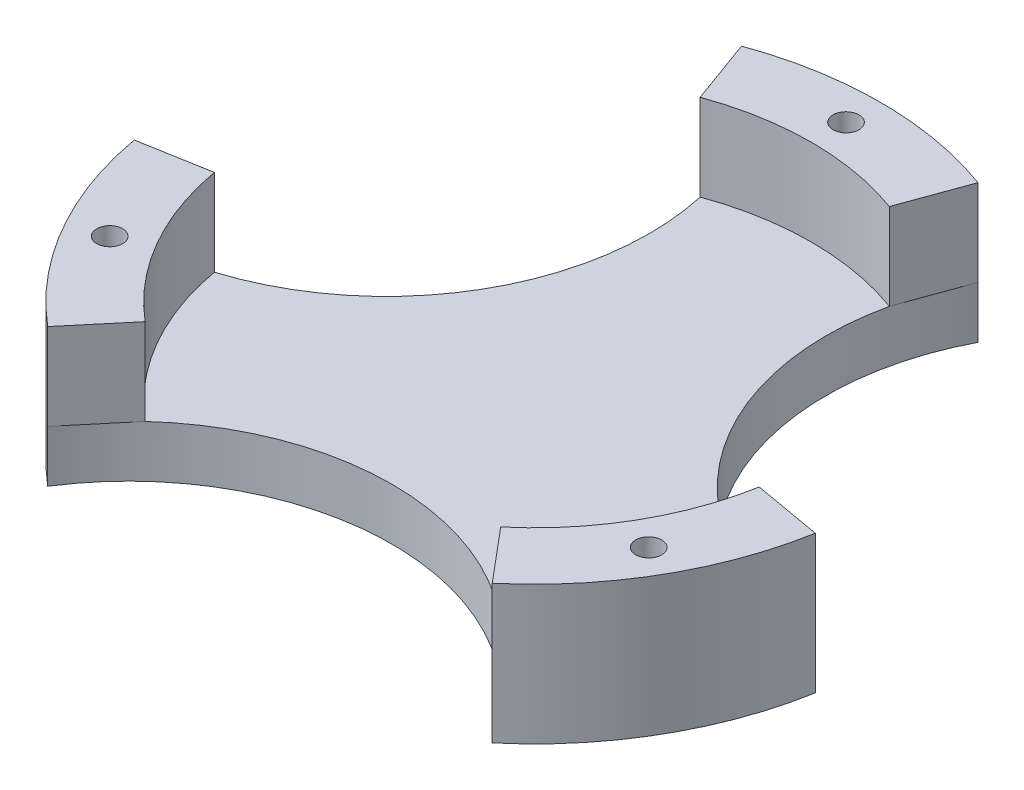
ISO-10303-21;
HEADER;
FILE_DESCRIPTION(('STEP AP214'),'2;1');
FILE_NAME('part.step','',(''),(''),'','','');
FILE_SCHEMA(('AUTOMOTIVE_DESIGN { 1 0 10303 214 1 1 1 1 }'));
ENDSEC;
DATA;
#1=APPLICATION_CONTEXT('core data for automotive mechanical design processes');
#2=APPLICATION_PROTOCOL_DEFINITION('international standard','automotive_design',2000,#1);
#3=PRODUCT_CONTEXT('',#1,'mechanical');
#4=PRODUCT('Part','Part','',(#3));
#5=PRODUCT_RELATED_PRODUCT_CATEGORY('part','',(#4));
#6=PRODUCT_DEFINITION_FORMATION('','',#4);
#7=PRODUCT_DEFINITION_CONTEXT('part definition',#1,'design');
#8=PRODUCT_DEFINITION('design','',#6,#7);
#9=PRODUCT_DEFINITION_SHAPE('','',#8);
#10=(LENGTH_UNIT() NAMED_UNIT(*) SI_UNIT(.MILLI.,.METRE.));
#11=(NAMED_UNIT(*) PLANE_ANGLE_UNIT() SI_UNIT($,.RADIAN.));
#12=(NAMED_UNIT(*) SI_UNIT($,.STERADIAN.) SOLID_ANGLE_UNIT());
#13=UNCERTAINTY_MEASURE_WITH_UNIT(LENGTH_MEASURE(1.E-05),#10,'distance_accuracy_value','');
#14=(GEOMETRIC_REPRESENTATION_CONTEXT(3) GLOBAL_UNCERTAINTY_ASSIGNED_CONTEXT((#13)) GLOBAL_UNIT_ASSIGNED_CONTEXT((#10,
#11,#12)) REPRESENTATION_CONTEXT('',''));
#15=CARTESIAN_POINT('',(0.,0.,0.));
#16=DIRECTION('',(0.,0.,1.));
#17=DIRECTION('',(1.,0.,0.));
#18=AXIS2_PLACEMENT_3D('',#15,#16,#17);
#19=CARTESIAN_POINT('',(0.,6.,0.));
#20=DIRECTION('',(0.,-1.,0.));
#21=DIRECTION('',(0.,0.,-1.));
#22=AXIS2_PLACEMENT_3D('',#19,#20,#21);
#23=CYLINDRICAL_SURFACE('',#22,40.);
#24=CARTESIAN_POINT('',(0.,0.,0.));
#25=DIRECTION('',(0.,1.,0.));
#26=DIRECTION('',(0.,0.,1.));
#27=AXIS2_PLACEMENT_3D('',#24,#25,#26);
#28=CIRCLE('',#27,40.);
#29=CARTESIAN_POINT('',(13.6808057330268,0.,-37.5877048314363));
#30=VERTEX_POINT('',#29);
#31=CARTESIAN_POINT('',(-13.680805733027,0.,-37.5877048314362));
#32=VERTEX_POINT('',#31);
#33=EDGE_CURVE('E11',#30,#32,#28,.T.);
#34=ORIENTED_EDGE('',*,*,#33,.T.);
#35=DIRECTION('',(0.,1.,0.));
#36=VECTOR('',#35,1.);
#37=CARTESIAN_POINT('',(-13.680805733027,3.,-37.5877048314362));
#38=LINE('',#37,#36);
#39=CARTESIAN_POINT('',(-13.6808057330251,6.,-37.5877048314326));
#40=VERTEX_POINT('',#39);
#41=EDGE_CURVE('E299',#32,#40,#38,.T.);
#42=ORIENTED_EDGE('',*,*,#41,.T.);
#43=DIRECTION('',(0.,-1.,0.));
#44=VECTOR('',#43,1.);
#45=CARTESIAN_POINT('',(-13.6808057330265,16.,-37.5877048314364));
#46=LINE('',#45,#44);
#47=CARTESIAN_POINT('',(-13.6808057330265,16.,-37.5877048314364));
#48=VERTEX_POINT('',#47);
#49=EDGE_CURVE('E263',#48,#40,#46,.T.);
#50=ORIENTED_EDGE('',*,*,#49,.F.);
#51=CARTESIAN_POINT('',(0.,16.,0.));
#52=DIRECTION('',(0.,1.,0.));
#53=DIRECTION('',(0.,0.,1.));
#54=AXIS2_PLACEMENT_3D('',#51,#52,#53);
#55=CIRCLE('',#54,40.);
#56=CARTESIAN_POINT('',(13.6808057330268,16.,-37.5877048314363));
#57=VERTEX_POINT('',#56);
#58=EDGE_CURVE('E241',#57,#48,#55,.T.);
#59=ORIENTED_EDGE('',*,*,#58,.F.);
#60=DIRECTION('',(0.,-1.,0.));
#61=VECTOR('',#60,1.);
#62=CARTESIAN_POINT('',(13.6808057330268,16.,-37.5877048314363));
#63=LINE('',#62,#61);
#64=CARTESIAN_POINT('',(13.6808057330268,6.,-37.5877048314364));
#65=VERTEX_POINT('',#64);
#66=EDGE_CURVE('E248',#57,#65,#63,.T.);
#67=ORIENTED_EDGE('',*,*,#66,.T.);
#68=DIRECTION('',(0.,1.,0.));
#69=VECTOR('',#68,1.);
#70=CARTESIAN_POINT('',(13.6808057330268,3.,-37.5877048314363));
#71=LINE('',#70,#69);
#72=EDGE_CURVE('E305',#65,#30,#71,.F.);
#73=ORIENTED_EDGE('',*,*,#72,.T.);
#74=EDGE_LOOP('',(#34,#42,#50,#59,#67,#73));
#75=FACE_BOUND('',#74,.T.);
#76=ADVANCED_FACE('F39',(#75),#23,.T.);
#77=DIRECTION('',(0.,-1.,0.));
#78=VECTOR('',#77,1.);
#79=CARTESIAN_POINT('',(-39.3923101204883,16.,6.94592710667737));
#80=LINE('',#79,#78);
#81=CARTESIAN_POINT('',(-39.3923101204883,16.,6.94592710667737));
#82=VERTEX_POINT('',#81);
#83=CARTESIAN_POINT('',(-39.3923101204883,6.,6.94592710667737));
#84=VERTEX_POINT('',#83);
#85=EDGE_CURVE('E218',#82,#84,#80,.T.);
#86=ORIENTED_EDGE('',*,*,#85,.T.);
#87=DIRECTION('',(0.,1.,0.));
#88=VECTOR('',#87,1.);
#89=CARTESIAN_POINT('',(-39.3923101204883,3.,6.94592710667738));
#90=LINE('',#89,#88);
#91=CARTESIAN_POINT('',(-39.3923101204883,0.,6.94592710667738));
#92=VERTEX_POINT('',#91);
#93=EDGE_CURVE('E280',#84,#92,#90,.F.);
#94=ORIENTED_EDGE('',*,*,#93,.T.);
#95=CARTESIAN_POINT('',(-25.7115043874612,0.,30.6417777247594));
#96=VERTEX_POINT('',#95);
#97=EDGE_CURVE('E47',#92,#96,#28,.T.);
#98=ORIENTED_EDGE('',*,*,#97,.T.);
#99=DIRECTION('',(0.,1.,0.));
#100=VECTOR('',#99,1.);
#101=CARTESIAN_POINT('',(-25.7115043874612,3.,30.6417777247594));
#102=LINE('',#101,#100);
#103=CARTESIAN_POINT('',(-25.711504387459,6.,30.641777724756));
#104=VERTEX_POINT('',#103);
#105=EDGE_CURVE('E278',#96,#104,#102,.T.);
#106=ORIENTED_EDGE('',*,*,#105,.T.);
#107=DIRECTION('',(0.,-1.,0.));
#108=VECTOR('',#107,1.);
#109=CARTESIAN_POINT('',(-25.7115043874616,16.,30.6417777247591));
#110=LINE('',#109,#108);
#111=CARTESIAN_POINT('',(-25.7115043874616,16.,30.6417777247591));
#112=VERTEX_POINT('',#111);
#113=EDGE_CURVE('E231',#112,#104,#110,.T.);
#114=ORIENTED_EDGE('',*,*,#113,.F.);
#115=CARTESIAN_POINT('',(0.,16.,0.));
#116=DIRECTION('',(0.,1.,0.));
#117=DIRECTION('',(0.866025403784436,0.,-0.500000000000004));
#118=AXIS2_PLACEMENT_3D('',#115,#116,#117);
#119=CIRCLE('',#118,40.);
#120=EDGE_CURVE('E208',#82,#112,#119,.T.);
#121=ORIENTED_EDGE('',*,*,#120,.F.);
#122=EDGE_LOOP('',(#86,#94,#98,#106,#114,#121));
#123=FACE_BOUND('',#122,.T.);
#124=ADVANCED_FACE('F276',(#123),#23,.T.);
#125=DIRECTION('',(0.,-1.,0.));
#126=VECTOR('',#125,1.);
#127=CARTESIAN_POINT('',(25.7115043874618,16.,30.6417777247589));
#128=LINE('',#127,#126);
#129=CARTESIAN_POINT('',(25.7115043874618,16.,30.6417777247589));
#130=VERTEX_POINT('',#129);
#131=CARTESIAN_POINT('',(25.7115043874618,6.,30.6417777247589));
#132=VERTEX_POINT('',#131);
#133=EDGE_CURVE('E187',#130,#132,#128,.T.);
#134=ORIENTED_EDGE('',*,*,#133,.T.);
#135=DIRECTION('',(0.,1.,0.));
#136=VECTOR('',#135,1.);
#137=CARTESIAN_POINT('',(25.7115043874618,3.,30.6417777247589));
#138=LINE('',#137,#136);
#139=CARTESIAN_POINT('',(25.7115043874618,0.,30.6417777247589));
#140=VERTEX_POINT('',#139);
#141=EDGE_CURVE('E166',#132,#140,#138,.F.);
#142=ORIENTED_EDGE('',*,*,#141,.T.);
#143=CARTESIAN_POINT('',(39.3923101204883,0.,6.9459271066771));
#144=VERTEX_POINT('',#143);
#145=EDGE_CURVE('E48',#140,#144,#28,.T.);
#146=ORIENTED_EDGE('',*,*,#145,.T.);
#147=DIRECTION('',(0.,1.,0.));
#148=VECTOR('',#147,1.);
#149=CARTESIAN_POINT('',(39.3923101204883,3.,6.9459271066771));
#150=LINE('',#149,#148);
#151=CARTESIAN_POINT('',(39.3923101204885,6.,6.94592710667711));
#152=VERTEX_POINT('',#151);
#153=EDGE_CURVE('E312',#144,#152,#150,.T.);
#154=ORIENTED_EDGE('',*,*,#153,.T.);
#155=DIRECTION('',(0.,-1.,0.));
#156=VECTOR('',#155,1.);
#157=CARTESIAN_POINT('',(39.3923101204883,16.,6.94592710667708));
#158=LINE('',#157,#156);
#159=CARTESIAN_POINT('',(39.3923101204883,16.,6.94592710667708));
#160=VERTEX_POINT('',#159);
#161=EDGE_CURVE('E201',#160,#152,#158,.T.);
#162=ORIENTED_EDGE('',*,*,#161,.F.);
#163=CARTESIAN_POINT('',(0.,16.,0.));
#164=DIRECTION('',(0.,1.,0.));
#165=DIRECTION('',(-0.866025403784443,0.,-0.499999999999992));
#166=AXIS2_PLACEMENT_3D('',#163,#164,#165);
#167=CIRCLE('',#166,40.);
#168=EDGE_CURVE('E155',#130,#160,#167,.T.);
#169=ORIENTED_EDGE('',*,*,#168,.F.);
#170=EDGE_LOOP('',(#134,#142,#146,#154,#162,#169));
#171=FACE_BOUND('',#170,.T.);
#172=ADVANCED_FACE('F41',(#171),#23,.T.);
#173=CARTESIAN_POINT('',(0.,6.,0.));
#174=DIRECTION('',(0.,1.,0.));
#175=DIRECTION('',(0.,0.,1.));
#176=AXIS2_PLACEMENT_3D('',#173,#174,#175);
#177=PLANE('',#176);
#178=CARTESIAN_POINT('',(-40.698571494497,6.,-23.4973312079807));
#179=DIRECTION('',(0.,1.,0.));
#180=DIRECTION('',(0.866025403784436,0.,-0.500000000000004));
#181=AXIS2_PLACEMENT_3D('',#178,#179,#180);
#182=CIRCLE('',#181,30.4712700029097);
#183=CARTESIAN_POINT('',(-31.5138480963906,6.,5.55674168534189));
#184=VERTEX_POINT('',#183);
#185=CARTESIAN_POINT('',(-10.9446445864216,6.,-30.070163865149));
#186=VERTEX_POINT('',#185);
#187=EDGE_CURVE('E291',#184,#186,#182,.T.);
#188=ORIENTED_EDGE('',*,*,#187,.F.);
#189=CARTESIAN_POINT('',(0.,6.,0.));
#190=DIRECTION('',(0.,-1.,0.));
#191=DIRECTION('',(0.866025403784436,0.,-0.500000000000004));
#192=AXIS2_PLACEMENT_3D('',#189,#190,#191);
#193=CIRCLE('',#192,32.);
#194=CARTESIAN_POINT('',(-20.569203509969,6.,24.5134221798075));
#195=VERTEX_POINT('',#194);
#196=EDGE_CURVE('E178',#195,#184,#193,.T.);
#197=ORIENTED_EDGE('',*,*,#196,.F.);
#198=CARTESIAN_POINT('',(4.8919202022546E-13,6.,46.9946624159619));
#199=DIRECTION('',(0.,1.,0.));
#200=DIRECTION('',(-0.866025403784443,0.,-0.499999999999992));
#201=AXIS2_PLACEMENT_3D('',#198,#199,#200);
#202=CIRCLE('',#201,30.4712700029097);
#203=CARTESIAN_POINT('',(20.5692035099694,6.,24.5134221798071));
#204=VERTEX_POINT('',#203);
#205=EDGE_CURVE('E163',#204,#195,#202,.T.);
#206=ORIENTED_EDGE('',*,*,#205,.F.);
#207=CARTESIAN_POINT('',(0.,6.,0.));
#208=DIRECTION('',(0.,-1.,0.));
#209=DIRECTION('',(-0.866025403784443,0.,-0.499999999999992));
#210=AXIS2_PLACEMENT_3D('',#207,#208,#209);
#211=CIRCLE('',#210,32.);
#212=CARTESIAN_POINT('',(31.5138480963907,6.,5.55674168534168));
#213=VERTEX_POINT('',#212);
#214=EDGE_CURVE('E156',#213,#204,#211,.T.);
#215=ORIENTED_EDGE('',*,*,#214,.F.);
#216=CARTESIAN_POINT('',(40.6985714944968,6.,-23.497331207981));
#217=DIRECTION('',(0.,1.,0.));
#218=DIRECTION('',(0.,0.,1.));
#219=AXIS2_PLACEMENT_3D('',#216,#217,#218);
#220=CIRCLE('',#219,30.4712700029097);
#221=CARTESIAN_POINT('',(10.9446445864214,6.,-30.070163865149));
#222=VERTEX_POINT('',#221);
#223=EDGE_CURVE('E309',#222,#213,#220,.T.);
#224=ORIENTED_EDGE('',*,*,#223,.F.);
#225=CARTESIAN_POINT('',(0.,6.,0.));
#226=DIRECTION('',(0.,-1.,0.));
#227=DIRECTION('',(0.,0.,1.));
#228=AXIS2_PLACEMENT_3D('',#225,#226,#227);
#229=CIRCLE('',#228,32.);
#230=EDGE_CURVE('E251',#186,#222,#229,.T.);
#231=ORIENTED_EDGE('',*,*,#230,.F.);
#232=EDGE_LOOP('',(#188,#197,#206,#215,#224,#231));
#233=FACE_BOUND('',#232,.T.);
#234=ADVANCED_FACE('F174',(#233),#177,.T.);
#235=CARTESIAN_POINT('',(0.,0.,0.));
#236=DIRECTION('',(0.,1.,0.));
#237=DIRECTION('',(0.,0.,1.));
#238=AXIS2_PLACEMENT_3D('',#235,#236,#237);
#239=PLANE('',#238);
#240=CARTESIAN_POINT('',(-31.1769145362397,0.,18.0000000000001));
#241=DIRECTION('',(0.,1.,0.));
#242=DIRECTION('',(0.866025403784436,0.,-0.500000000000004));
#243=AXIS2_PLACEMENT_3D('',#240,#241,#242);
#244=CIRCLE('',#243,1.5);
#245=CARTESIAN_POINT('',(-29.8778764305631,0.,17.2500000000001));
#246=VERTEX_POINT('',#245);
#247=EDGE_CURVE('E315',#246,#246,#244,.T.);
#248=ORIENTED_EDGE('',*,*,#247,.T.);
#249=EDGE_LOOP('',(#248));
#250=FACE_BOUND('',#249,.T.);
#251=CARTESIAN_POINT('',(31.17691453624,0.,17.9999999999997));
#252=DIRECTION('',(0.,1.,0.));
#253=DIRECTION('',(-0.866025403784443,0.,-0.499999999999992));
#254=AXIS2_PLACEMENT_3D('',#251,#252,#253);
#255=CIRCLE('',#254,1.5);
#256=CARTESIAN_POINT('',(29.8778764305633,0.,17.2499999999997));
#257=VERTEX_POINT('',#256);
#258=EDGE_CURVE('E314',#257,#257,#255,.T.);
#259=ORIENTED_EDGE('',*,*,#258,.T.);
#260=EDGE_LOOP('',(#259));
#261=FACE_BOUND('',#260,.T.);
#262=CARTESIAN_POINT('',(0.,0.,-36.));
#263=DIRECTION('',(0.,1.,0.));
#264=DIRECTION('',(0.,0.,1.));
#265=AXIS2_PLACEMENT_3D('',#262,#263,#264);
#266=CIRCLE('',#265,1.5);
#267=CARTESIAN_POINT('',(0.,0.,-34.5));
#268=VERTEX_POINT('',#267);
#269=EDGE_CURVE('E234',#268,#268,#266,.T.);
#270=ORIENTED_EDGE('',*,*,#269,.T.);
#271=EDGE_LOOP('',(#270));
#272=FACE_BOUND('',#271,.T.);
#273=ORIENTED_EDGE('',*,*,#97,.F.);
#274=CARTESIAN_POINT('',(-40.698571494497,0.,-23.4973312079807));
#275=DIRECTION('',(0.,1.,0.));
#276=DIRECTION('',(0.866025403784436,0.,-0.500000000000004));
#277=AXIS2_PLACEMENT_3D('',#274,#275,#276);
#278=CIRCLE('',#277,30.4712700029097);
#279=EDGE_CURVE('E286',#92,#32,#278,.T.);
#280=ORIENTED_EDGE('',*,*,#279,.T.);
#281=ORIENTED_EDGE('',*,*,#33,.F.);
#282=CARTESIAN_POINT('',(40.6985714944968,0.,-23.497331207981));
#283=DIRECTION('',(0.,1.,0.));
#284=DIRECTION('',(0.,0.,1.));
#285=AXIS2_PLACEMENT_3D('',#282,#283,#284);
#286=CIRCLE('',#285,30.4712700029097);
#287=EDGE_CURVE('E303',#30,#144,#286,.T.);
#288=ORIENTED_EDGE('',*,*,#287,.T.);
#289=ORIENTED_EDGE('',*,*,#145,.F.);
#290=CARTESIAN_POINT('',(4.8919202022546E-13,0.,46.9946624159619));
#291=DIRECTION('',(0.,1.,0.));
#292=DIRECTION('',(-0.866025403784443,0.,-0.499999999999992));
#293=AXIS2_PLACEMENT_3D('',#290,#291,#292);
#294=CIRCLE('',#293,30.4712700029097);
#295=EDGE_CURVE('E167',#140,#96,#294,.T.);
#296=ORIENTED_EDGE('',*,*,#295,.T.);
#297=EDGE_LOOP('',(#273,#280,#281,#288,#289,#296));
#298=FACE_BOUND('',#297,.T.);
#299=ADVANCED_FACE('F284',(#250,#261,#272,#298),#239,.F.);
#300=CARTESIAN_POINT('',(0.,16.,0.));
#301=DIRECTION('',(0.,1.,0.));
#302=DIRECTION('',(0.,0.,1.));
#303=AXIS2_PLACEMENT_3D('',#300,#301,#302);
#304=PLANE('',#303);
#305=ORIENTED_EDGE('',*,*,#58,.T.);
#306=DIRECTION('',(0.342020143325663,0.,0.93969262078591));
#307=VECTOR('',#306,1.);
#308=CARTESIAN_POINT('',(-13.6808057330265,16.,-37.5877048314364));
#309=LINE('',#308,#307);
#310=CARTESIAN_POINT('',(-10.9446445864212,16.,-30.0701638651491));
#311=VERTEX_POINT('',#310);
#312=EDGE_CURVE('E243',#48,#311,#309,.T.);
#313=ORIENTED_EDGE('',*,*,#312,.T.);
#314=CARTESIAN_POINT('',(0.,16.,0.));
#315=DIRECTION('',(0.,-1.,0.));
#316=DIRECTION('',(0.,0.,1.));
#317=AXIS2_PLACEMENT_3D('',#314,#315,#316);
#318=CIRCLE('',#317,32.);
#319=CARTESIAN_POINT('',(10.9446445864214,16.,-30.0701638651491));
#320=VERTEX_POINT('',#319);
#321=EDGE_CURVE('E60',#311,#320,#318,.T.);
#322=ORIENTED_EDGE('',*,*,#321,.T.);
#323=DIRECTION('',(0.34202014332567,0.,-0.939692620785908));
#324=VECTOR('',#323,1.);
#325=CARTESIAN_POINT('',(10.9446445864214,16.,-30.0701638651491));
#326=LINE('',#325,#324);
#327=EDGE_CURVE('E55',#320,#57,#326,.T.);
#328=ORIENTED_EDGE('',*,*,#327,.T.);
#329=EDGE_LOOP('',(#305,#313,#322,#328));
#330=FACE_BOUND('',#329,.T.);
#331=CARTESIAN_POINT('',(0.,16.,-36.));
#332=DIRECTION('',(0.,1.,0.));
#333=DIRECTION('',(0.,0.,1.));
#334=AXIS2_PLACEMENT_3D('',#331,#332,#333);
#335=CIRCLE('',#334,1.5);
#336=CARTESIAN_POINT('',(0.,16.,-34.5));
#337=VERTEX_POINT('',#336);
#338=EDGE_CURVE('E237',#337,#337,#335,.T.);
#339=ORIENTED_EDGE('',*,*,#338,.F.);
#340=EDGE_LOOP('',(#339));
#341=FACE_BOUND('',#340,.T.);
#342=ADVANCED_FACE('F349',(#330,#341),#304,.T.);
#343=CARTESIAN_POINT('',(-13.6808057330265,16.,-37.5877048314364));
#344=DIRECTION('',(0.93969262078591,0.,-0.342020143325663));
#345=DIRECTION('',(-0.342020143325663,0.,-0.93969262078591));
#346=AXIS2_PLACEMENT_3D('',#343,#344,#345);
#347=PLANE('',#346);
#348=DIRECTION('',(0.342020143325663,0.,0.93969262078591));
#349=VECTOR('',#348,1.);
#350=CARTESIAN_POINT('',(-13.6808057330265,6.,-37.5877048314364));
#351=LINE('',#350,#349);
#352=EDGE_CURVE('E240',#40,#186,#351,.T.);
#353=ORIENTED_EDGE('',*,*,#352,.T.);
#354=DIRECTION('',(0.,-1.,0.));
#355=VECTOR('',#354,1.);
#356=CARTESIAN_POINT('',(-10.9446445864212,16.,-30.0701638651491));
#357=LINE('',#356,#355);
#358=EDGE_CURVE('E261',#311,#186,#357,.T.);
#359=ORIENTED_EDGE('',*,*,#358,.F.);
#360=ORIENTED_EDGE('',*,*,#312,.F.);
#361=ORIENTED_EDGE('',*,*,#49,.T.);
#362=EDGE_LOOP('',(#353,#359,#360,#361));
#363=FACE_BOUND('',#362,.T.);
#364=ADVANCED_FACE('F351',(#363),#347,.F.);
#365=CARTESIAN_POINT('',(0.,16.,0.));
#366=DIRECTION('',(0.,-1.,0.));
#367=DIRECTION('',(0.,0.,-1.));
#368=AXIS2_PLACEMENT_3D('',#365,#366,#367);
#369=CYLINDRICAL_SURFACE('',#368,32.);
#370=ORIENTED_EDGE('',*,*,#230,.T.);
#371=DIRECTION('',(0.,-1.,0.));
#372=VECTOR('',#371,1.);
#373=CARTESIAN_POINT('',(10.9446445864214,16.,-30.0701638651491));
#374=LINE('',#373,#372);
#375=EDGE_CURVE('E258',#320,#222,#374,.T.);
#376=ORIENTED_EDGE('',*,*,#375,.F.);
#377=ORIENTED_EDGE('',*,*,#321,.F.);
#378=ORIENTED_EDGE('',*,*,#358,.T.);
#379=EDGE_LOOP('',(#370,#376,#377,#378));
#380=FACE_BOUND('',#379,.T.);
#381=ADVANCED_FACE('F343',(#380),#369,.F.);
#382=CARTESIAN_POINT('',(10.9446445864214,16.,-30.0701638651491));
#383=DIRECTION('',(-0.939692620785908,0.,-0.34202014332567));
#384=DIRECTION('',(-0.34202014332567,0.,0.939692620785908));
#385=AXIS2_PLACEMENT_3D('',#382,#383,#384);
#386=PLANE('',#385);
#387=DIRECTION('',(0.34202014332567,0.,-0.939692620785908));
#388=VECTOR('',#387,1.);
#389=CARTESIAN_POINT('',(10.9446445864214,6.,-30.0701638651491));
#390=LINE('',#389,#388);
#391=EDGE_CURVE('E244',#222,#65,#390,.T.);
#392=ORIENTED_EDGE('',*,*,#391,.T.);
#393=ORIENTED_EDGE('',*,*,#66,.F.);
#394=ORIENTED_EDGE('',*,*,#327,.F.);
#395=ORIENTED_EDGE('',*,*,#375,.T.);
#396=EDGE_LOOP('',(#392,#393,#394,#395));
#397=FACE_BOUND('',#396,.T.);
#398=ADVANCED_FACE('F346',(#397),#386,.F.);
#399=CARTESIAN_POINT('',(0.,16.,-36.));
#400=DIRECTION('',(0.,-1.,0.));
#401=DIRECTION('',(0.,0.,-1.));
#402=AXIS2_PLACEMENT_3D('',#399,#400,#401);
#403=CYLINDRICAL_SURFACE('',#402,1.5);
#404=ORIENTED_EDGE('',*,*,#338,.T.);
#405=EDGE_LOOP('',(#404));
#406=FACE_BOUND('',#405,.T.);
#407=ORIENTED_EDGE('',*,*,#269,.F.);
#408=EDGE_LOOP('',(#407));
#409=FACE_BOUND('',#408,.T.);
#410=ADVANCED_FACE('F389',(#406,#409),#403,.F.);
#411=CARTESIAN_POINT('',(0.,16.,0.));
#412=DIRECTION('',(0.,1.,0.));
#413=DIRECTION('',(0.866025403784436,0.,-0.500000000000004));
#414=AXIS2_PLACEMENT_3D('',#411,#412,#413);
#415=PLANE('',#414);
#416=ORIENTED_EDGE('',*,*,#120,.T.);
#417=DIRECTION('',(0.64278760968654,0.,-0.766044443118977));
#418=VECTOR('',#417,1.);
#419=CARTESIAN_POINT('',(-25.7115043874616,16.,30.6417777247591));
#420=LINE('',#419,#418);
#421=CARTESIAN_POINT('',(-20.5692035099693,16.,24.5134221798073));
#422=VERTEX_POINT('',#421);
#423=EDGE_CURVE('E211',#112,#422,#420,.T.);
#424=ORIENTED_EDGE('',*,*,#423,.T.);
#425=CARTESIAN_POINT('',(0.,16.,0.));
#426=DIRECTION('',(0.,-1.,0.));
#427=DIRECTION('',(0.866025403784436,0.,-0.500000000000004));
#428=AXIS2_PLACEMENT_3D('',#425,#426,#427);
#429=CIRCLE('',#428,32.);
#430=CARTESIAN_POINT('',(-31.5138480963906,16.,5.55674168534189));
#431=VERTEX_POINT('',#430);
#432=EDGE_CURVE('E214',#422,#431,#429,.T.);
#433=ORIENTED_EDGE('',*,*,#432,.T.);
#434=DIRECTION('',(-0.984807753012208,0.,0.173648177666934));
#435=VECTOR('',#434,1.);
#436=CARTESIAN_POINT('',(-31.5138480963906,16.,5.55674168534189));
#437=LINE('',#436,#435);
#438=EDGE_CURVE('E216',#431,#82,#437,.T.);
#439=ORIENTED_EDGE('',*,*,#438,.T.);
#440=EDGE_LOOP('',(#416,#424,#433,#439));
#441=FACE_BOUND('',#440,.T.);
#442=CARTESIAN_POINT('',(-31.1769145362397,16.,18.0000000000001));
#443=DIRECTION('',(0.,1.,0.));
#444=DIRECTION('',(0.866025403784436,0.,-0.500000000000004));
#445=AXIS2_PLACEMENT_3D('',#442,#443,#444);
#446=CIRCLE('',#445,1.5);
#447=CARTESIAN_POINT('',(-29.8778764305631,16.,17.2500000000001));
#448=VERTEX_POINT('',#447);
#449=EDGE_CURVE('E204',#448,#448,#446,.T.);
#450=ORIENTED_EDGE('',*,*,#449,.F.);
#451=EDGE_LOOP('',(#450));
#452=FACE_BOUND('',#451,.T.);
#453=ADVANCED_FACE('F394',(#441,#452),#415,.T.);
#454=CARTESIAN_POINT('',(-25.7115043874616,16.,30.6417777247591));
#455=DIRECTION('',(-0.766044443118977,0.,-0.64278760968654));
#456=DIRECTION('',(-0.64278760968654,0.,0.766044443118977));
#457=AXIS2_PLACEMENT_3D('',#454,#455,#456);
#458=PLANE('',#457);
#459=DIRECTION('',(0.64278760968654,0.,-0.766044443118977));
#460=VECTOR('',#459,1.);
#461=CARTESIAN_POINT('',(-25.7115043874616,6.,30.6417777247591));
#462=LINE('',#461,#460);
#463=EDGE_CURVE('E207',#104,#195,#462,.T.);
#464=ORIENTED_EDGE('',*,*,#463,.T.);
#465=DIRECTION('',(0.,-1.,0.));
#466=VECTOR('',#465,1.);
#467=CARTESIAN_POINT('',(-20.5692035099693,16.,24.5134221798073));
#468=LINE('',#467,#466);
#469=EDGE_CURVE('E228',#422,#195,#468,.T.);
#470=ORIENTED_EDGE('',*,*,#469,.F.);
#471=ORIENTED_EDGE('',*,*,#423,.F.);
#472=ORIENTED_EDGE('',*,*,#113,.T.);
#473=EDGE_LOOP('',(#464,#470,#471,#472));
#474=FACE_BOUND('',#473,.T.);
#475=ADVANCED_FACE('F396',(#474),#458,.F.);
#476=CARTESIAN_POINT('',(0.,16.,0.));
#477=DIRECTION('',(0.,-1.,0.));
#478=DIRECTION('',(0.,0.,-1.));
#479=AXIS2_PLACEMENT_3D('',#476,#477,#478);
#480=CYLINDRICAL_SURFACE('',#479,32.);
#481=ORIENTED_EDGE('',*,*,#196,.T.);
#482=DIRECTION('',(0.,-1.,0.));
#483=VECTOR('',#482,1.);
#484=CARTESIAN_POINT('',(-31.5138480963906,16.,5.55674168534189));
#485=LINE('',#484,#483);
#486=EDGE_CURVE('E225',#431,#184,#485,.T.);
#487=ORIENTED_EDGE('',*,*,#486,.F.);
#488=ORIENTED_EDGE('',*,*,#432,.F.);
#489=ORIENTED_EDGE('',*,*,#469,.T.);
#490=EDGE_LOOP('',(#481,#487,#488,#489));
#491=FACE_BOUND('',#490,.T.);
#492=ADVANCED_FACE('F399',(#491),#480,.F.);
#493=CARTESIAN_POINT('',(-31.5138480963906,16.,5.55674168534189));
#494=DIRECTION('',(0.173648177666934,0.,0.984807753012208));
#495=DIRECTION('',(0.984807753012208,0.,-0.173648177666934));
#496=AXIS2_PLACEMENT_3D('',#493,#494,#495);
#497=PLANE('',#496);
#498=DIRECTION('',(-0.984807753012208,0.,0.173648177666934));
#499=VECTOR('',#498,1.);
#500=CARTESIAN_POINT('',(-31.5138480963906,6.,5.55674168534189));
#501=LINE('',#500,#499);
#502=EDGE_CURVE('E212',#184,#84,#501,.T.);
#503=ORIENTED_EDGE('',*,*,#502,.T.);
#504=ORIENTED_EDGE('',*,*,#85,.F.);
#505=ORIENTED_EDGE('',*,*,#438,.F.);
#506=ORIENTED_EDGE('',*,*,#486,.T.);
#507=EDGE_LOOP('',(#503,#504,#505,#506));
#508=FACE_BOUND('',#507,.T.);
#509=ADVANCED_FACE('F403',(#508),#497,.F.);
#510=CARTESIAN_POINT('',(-31.1769145362397,16.,18.0000000000001));
#511=DIRECTION('',(0.,-1.,0.));
#512=DIRECTION('',(0.,0.,-1.));
#513=AXIS2_PLACEMENT_3D('',#510,#511,#512);
#514=CYLINDRICAL_SURFACE('',#513,1.5);
#515=ORIENTED_EDGE('',*,*,#449,.T.);
#516=EDGE_LOOP('',(#515));
#517=FACE_BOUND('',#516,.T.);
#518=ORIENTED_EDGE('',*,*,#247,.F.);
#519=EDGE_LOOP('',(#518));
#520=FACE_BOUND('',#519,.T.);
#521=ADVANCED_FACE('F407',(#517,#520),#514,.F.);
#522=CARTESIAN_POINT('',(0.,16.,0.));
#523=DIRECTION('',(0.,1.,0.));
#524=DIRECTION('',(-0.866025403784443,0.,-0.499999999999992));
#525=AXIS2_PLACEMENT_3D('',#522,#523,#524);
#526=PLANE('',#525);
#527=ORIENTED_EDGE('',*,*,#168,.T.);
#528=DIRECTION('',(-0.984807753012209,0.,-0.173648177666927));
#529=VECTOR('',#528,1.);
#530=CARTESIAN_POINT('',(39.3923101204883,16.,6.94592710667708));
#531=LINE('',#530,#529);
#532=CARTESIAN_POINT('',(31.5138480963907,16.,5.55674168534168));
#533=VERTEX_POINT('',#532);
#534=EDGE_CURVE('E324',#160,#533,#531,.T.);
#535=ORIENTED_EDGE('',*,*,#534,.T.);
#536=CARTESIAN_POINT('',(0.,16.,0.));
#537=DIRECTION('',(0.,-1.,0.));
#538=DIRECTION('',(-0.866025403784443,0.,-0.499999999999992));
#539=AXIS2_PLACEMENT_3D('',#536,#537,#538);
#540=CIRCLE('',#539,32.);
#541=CARTESIAN_POINT('',(20.5692035099695,16.,24.5134221798071));
#542=VERTEX_POINT('',#541);
#543=EDGE_CURVE('E326',#533,#542,#540,.T.);
#544=ORIENTED_EDGE('',*,*,#543,.T.);
#545=DIRECTION('',(0.642787609686546,0.,0.766044443118973));
#546=VECTOR('',#545,1.);
#547=CARTESIAN_POINT('',(20.5692035099695,16.,24.5134221798071));
#548=LINE('',#547,#546);
#549=EDGE_CURVE('E183',#542,#130,#548,.T.);
#550=ORIENTED_EDGE('',*,*,#549,.T.);
#551=EDGE_LOOP('',(#527,#535,#544,#550));
#552=FACE_BOUND('',#551,.T.);
#553=CARTESIAN_POINT('',(31.17691453624,16.,17.9999999999997));
#554=DIRECTION('',(0.,1.,0.));
#555=DIRECTION('',(-0.866025403784443,0.,-0.499999999999992));
#556=AXIS2_PLACEMENT_3D('',#553,#554,#555);
#557=CIRCLE('',#556,1.5);
#558=CARTESIAN_POINT('',(29.8778764305633,16.,17.2499999999997));
#559=VERTEX_POINT('',#558);
#560=EDGE_CURVE('E195',#559,#559,#557,.T.);
#561=ORIENTED_EDGE('',*,*,#560,.F.);
#562=EDGE_LOOP('',(#561));
#563=FACE_BOUND('',#562,.T.);
#564=ADVANCED_FACE('F328',(#552,#563),#526,.T.);
#565=CARTESIAN_POINT('',(39.3923101204883,16.,6.94592710667708));
#566=DIRECTION('',(-0.173648177666927,0.,0.984807753012209));
#567=DIRECTION('',(0.984807753012209,0.,0.173648177666927));
#568=AXIS2_PLACEMENT_3D('',#565,#566,#567);
#569=PLANE('',#568);
#570=DIRECTION('',(-0.984807753012209,0.,-0.173648177666927));
#571=VECTOR('',#570,1.);
#572=CARTESIAN_POINT('',(39.3923101204883,6.,6.94592710667708));
#573=LINE('',#572,#571);
#574=EDGE_CURVE('E192',#152,#213,#573,.T.);
#575=ORIENTED_EDGE('',*,*,#574,.T.);
#576=DIRECTION('',(0.,-1.,0.));
#577=VECTOR('',#576,1.);
#578=CARTESIAN_POINT('',(31.5138480963907,16.,5.55674168534168));
#579=LINE('',#578,#577);
#580=EDGE_CURVE('E186',#533,#213,#579,.T.);
#581=ORIENTED_EDGE('',*,*,#580,.F.);
#582=ORIENTED_EDGE('',*,*,#534,.F.);
#583=ORIENTED_EDGE('',*,*,#161,.T.);
#584=EDGE_LOOP('',(#575,#581,#582,#583));
#585=FACE_BOUND('',#584,.T.);
#586=ADVANCED_FACE('F333',(#585),#569,.F.);
#587=CARTESIAN_POINT('',(0.,16.,0.));
#588=DIRECTION('',(0.,-1.,0.));
#589=DIRECTION('',(0.,0.,-1.));
#590=AXIS2_PLACEMENT_3D('',#587,#588,#589);
#591=CYLINDRICAL_SURFACE('',#590,32.);
#592=ORIENTED_EDGE('',*,*,#214,.T.);
#593=DIRECTION('',(0.,-1.,0.));
#594=VECTOR('',#593,1.);
#595=CARTESIAN_POINT('',(20.5692035099695,16.,24.5134221798071));
#596=LINE('',#595,#594);
#597=EDGE_CURVE('E181',#542,#204,#596,.T.);
#598=ORIENTED_EDGE('',*,*,#597,.F.);
#599=ORIENTED_EDGE('',*,*,#543,.F.);
#600=ORIENTED_EDGE('',*,*,#580,.T.);
#601=EDGE_LOOP('',(#592,#598,#599,#600));
#602=FACE_BOUND('',#601,.T.);
#603=ADVANCED_FACE('F190',(#602),#591,.F.);
#604=CARTESIAN_POINT('',(20.5692035099695,16.,24.5134221798071));
#605=DIRECTION('',(0.766044443118973,0.,-0.642787609686546));
#606=DIRECTION('',(-0.642787609686546,0.,-0.766044443118973));
#607=AXIS2_PLACEMENT_3D('',#604,#605,#606);
#608=PLANE('',#607);
#609=DIRECTION('',(0.642787609686546,0.,0.766044443118973));
#610=VECTOR('',#609,1.);
#611=CARTESIAN_POINT('',(20.5692035099695,6.,24.5134221798071));
#612=LINE('',#611,#610);
#613=EDGE_CURVE('E146',#204,#132,#612,.T.);
#614=ORIENTED_EDGE('',*,*,#613,.T.);
#615=ORIENTED_EDGE('',*,*,#133,.F.);
#616=ORIENTED_EDGE('',*,*,#549,.F.);
#617=ORIENTED_EDGE('',*,*,#597,.T.);
#618=EDGE_LOOP('',(#614,#615,#616,#617));
#619=FACE_BOUND('',#618,.T.);
#620=ADVANCED_FACE('F182',(#619),#608,.F.);
#621=CARTESIAN_POINT('',(31.17691453624,16.,17.9999999999997));
#622=DIRECTION('',(0.,-1.,0.));
#623=DIRECTION('',(0.,0.,-1.));
#624=AXIS2_PLACEMENT_3D('',#621,#622,#623);
#625=CYLINDRICAL_SURFACE('',#624,1.5);
#626=ORIENTED_EDGE('',*,*,#560,.T.);
#627=EDGE_LOOP('',(#626));
#628=FACE_BOUND('',#627,.T.);
#629=ORIENTED_EDGE('',*,*,#258,.F.);
#630=EDGE_LOOP('',(#629));
#631=FACE_BOUND('',#630,.T.);
#632=ADVANCED_FACE('F366',(#628,#631),#625,.F.);
#633=CARTESIAN_POINT('',(40.6985714944968,0.,-23.497331207981));
#634=DIRECTION('',(0.,1.,0.));
#635=DIRECTION('',(0.,0.,1.));
#636=AXIS2_PLACEMENT_3D('',#633,#634,#635);
#637=CYLINDRICAL_SURFACE('',#636,30.4712700029097);
#638=ORIENTED_EDGE('',*,*,#287,.F.);
#639=ORIENTED_EDGE('',*,*,#72,.F.);
#640=EDGE_CURVE('E306',#65,#222,#220,.T.);
#641=ORIENTED_EDGE('',*,*,#640,.T.);
#642=ORIENTED_EDGE('',*,*,#223,.T.);
#643=EDGE_CURVE('E302',#213,#152,#220,.T.);
#644=ORIENTED_EDGE('',*,*,#643,.T.);
#645=ORIENTED_EDGE('',*,*,#153,.F.);
#646=EDGE_LOOP('',(#638,#639,#641,#642,#644,#645));
#647=FACE_BOUND('',#646,.T.);
#648=ADVANCED_FACE('F339',(#647),#637,.F.);
#649=CARTESIAN_POINT('',(40.6985714944968,6.,-23.497331207981));
#650=DIRECTION('',(0.,1.,0.));
#651=DIRECTION('',(0.,0.,1.));
#652=AXIS2_PLACEMENT_3D('',#649,#650,#651);
#653=PLANE('',#652);
#654=ORIENTED_EDGE('',*,*,#640,.F.);
#655=ORIENTED_EDGE('',*,*,#391,.F.);
#656=EDGE_LOOP('',(#654,#655));
#657=FACE_BOUND('',#656,.T.);
#658=ADVANCED_FACE('F359',(#657),#653,.F.);
#659=ORIENTED_EDGE('',*,*,#643,.F.);
#660=ORIENTED_EDGE('',*,*,#574,.F.);
#661=EDGE_LOOP('',(#659,#660));
#662=FACE_BOUND('',#661,.T.);
#663=ADVANCED_FACE('F337',(#662),#653,.F.);
#664=CARTESIAN_POINT('',(4.8919202022546E-13,0.,46.9946624159619));
#665=DIRECTION('',(0.,1.,0.));
#666=DIRECTION('',(0.,0.,1.));
#667=AXIS2_PLACEMENT_3D('',#664,#665,#666);
#668=CYLINDRICAL_SURFACE('',#667,30.4712700029097);
#669=ORIENTED_EDGE('',*,*,#295,.F.);
#670=ORIENTED_EDGE('',*,*,#141,.F.);
#671=EDGE_CURVE('E149',#132,#204,#202,.T.);
#672=ORIENTED_EDGE('',*,*,#671,.T.);
#673=ORIENTED_EDGE('',*,*,#205,.T.);
#674=EDGE_CURVE('E169',#195,#104,#202,.T.);
#675=ORIENTED_EDGE('',*,*,#674,.T.);
#676=ORIENTED_EDGE('',*,*,#105,.F.);
#677=EDGE_LOOP('',(#669,#670,#672,#673,#675,#676));
#678=FACE_BOUND('',#677,.T.);
#679=ADVANCED_FACE('F161',(#678),#668,.F.);
#680=CARTESIAN_POINT('',(4.8919202022546E-13,6.,46.9946624159619));
#681=DIRECTION('',(0.,1.,0.));
#682=DIRECTION('',(-0.866025403784443,0.,-0.499999999999992));
#683=AXIS2_PLACEMENT_3D('',#680,#681,#682);
#684=PLANE('',#683);
#685=ORIENTED_EDGE('',*,*,#674,.F.);
#686=ORIENTED_EDGE('',*,*,#463,.F.);
#687=EDGE_LOOP('',(#685,#686));
#688=FACE_BOUND('',#687,.T.);
#689=ADVANCED_FACE('F551',(#688),#684,.F.);
#690=ORIENTED_EDGE('',*,*,#671,.F.);
#691=ORIENTED_EDGE('',*,*,#613,.F.);
#692=EDGE_LOOP('',(#690,#691));
#693=FACE_BOUND('',#692,.T.);
#694=ADVANCED_FACE('F148',(#693),#684,.F.);
#695=CARTESIAN_POINT('',(-40.698571494497,0.,-23.4973312079807));
#696=DIRECTION('',(0.,1.,0.));
#697=DIRECTION('',(0.,0.,1.));
#698=AXIS2_PLACEMENT_3D('',#695,#696,#697);
#699=CYLINDRICAL_SURFACE('',#698,30.4712700029097);
#700=ORIENTED_EDGE('',*,*,#279,.F.);
#701=ORIENTED_EDGE('',*,*,#93,.F.);
#702=EDGE_CURVE('E293',#84,#184,#182,.T.);
#703=ORIENTED_EDGE('',*,*,#702,.T.);
#704=ORIENTED_EDGE('',*,*,#187,.T.);
#705=EDGE_CURVE('E288',#186,#40,#182,.T.);
#706=ORIENTED_EDGE('',*,*,#705,.T.);
#707=ORIENTED_EDGE('',*,*,#41,.F.);
#708=EDGE_LOOP('',(#700,#701,#703,#704,#706,#707));
#709=FACE_BOUND('',#708,.T.);
#710=ADVANCED_FACE('F356',(#709),#699,.F.);
#711=CARTESIAN_POINT('',(-40.698571494497,6.,-23.4973312079807));
#712=DIRECTION('',(0.,1.,0.));
#713=DIRECTION('',(0.866025403784436,0.,-0.500000000000004));
#714=AXIS2_PLACEMENT_3D('',#711,#712,#713);
#715=PLANE('',#714);
#716=ORIENTED_EDGE('',*,*,#705,.F.);
#717=ORIENTED_EDGE('',*,*,#352,.F.);
#718=EDGE_LOOP('',(#716,#717));
#719=FACE_BOUND('',#718,.T.);
#720=ADVANCED_FACE('F353',(#719),#715,.F.);
#721=ORIENTED_EDGE('',*,*,#702,.F.);
#722=ORIENTED_EDGE('',*,*,#502,.F.);
#723=EDGE_LOOP('',(#721,#722));
#724=FACE_BOUND('',#723,.T.);
#725=ADVANCED_FACE('F587',(#724),#715,.F.);
#726=CLOSED_SHELL('',(#76,#124,#172,#234,#299,#342,#364,#381,#398,#410,#453,#475,#492,#509,#521,
#564,#586,#603,#620,#632,#648,#658,#663,#679,#689,#694,#710,#720,#725));
#727=MANIFOLD_SOLID_BREP('B2',#726);
#728=ADVANCED_BREP_SHAPE_REPRESENTATION('',(#18,#727),#14);
#729=SHAPE_DEFINITION_REPRESENTATION(#9,#728);
ENDSEC;
END-ISO-10303-21;
